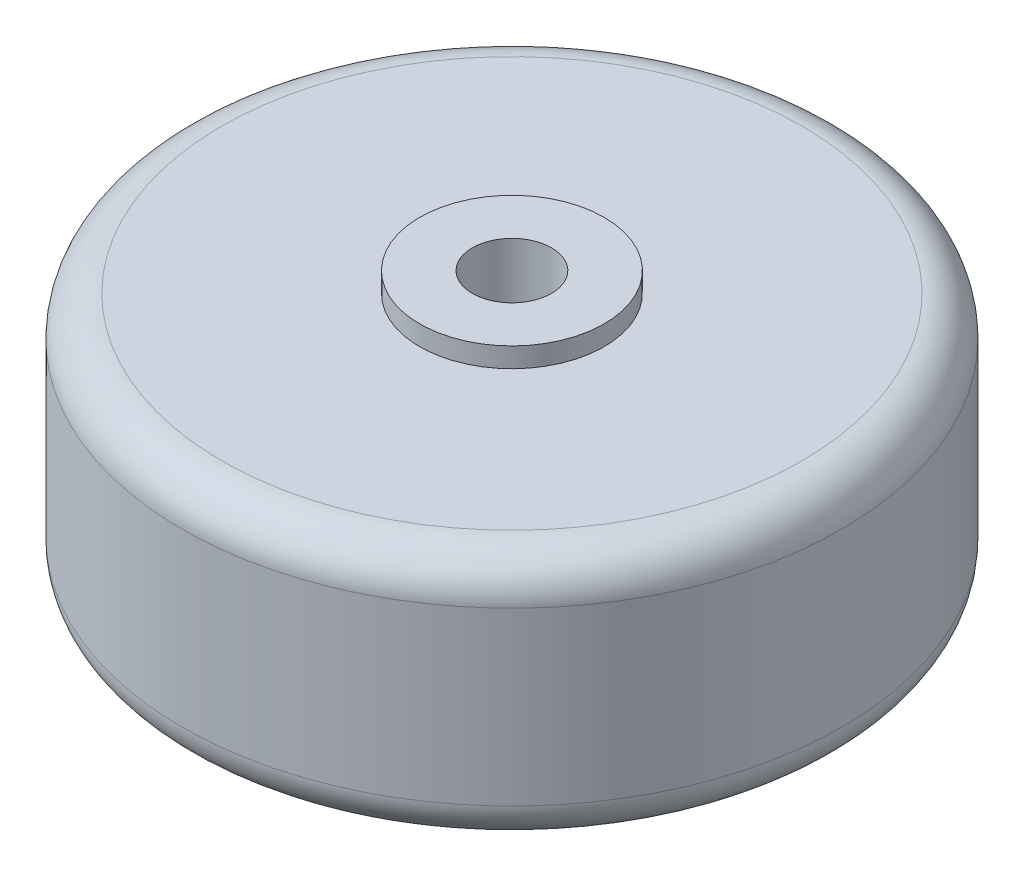
ISO-10303-21;
HEADER;
FILE_DESCRIPTION(('STEP AP214'),'2;1');
FILE_NAME('part.step','',(''),(''),'','','');
FILE_SCHEMA(('AUTOMOTIVE_DESIGN { 1 0 10303 214 1 1 1 1 }'));
ENDSEC;
DATA;
#1=APPLICATION_CONTEXT('core data for automotive mechanical design processes');
#2=APPLICATION_PROTOCOL_DEFINITION('international standard','automotive_design',2000,#1);
#3=PRODUCT_CONTEXT('',#1,'mechanical');
#4=PRODUCT('Part','Part','',(#3));
#5=PRODUCT_RELATED_PRODUCT_CATEGORY('part','',(#4));
#6=PRODUCT_DEFINITION_FORMATION('','',#4);
#7=PRODUCT_DEFINITION_CONTEXT('part definition',#1,'design');
#8=PRODUCT_DEFINITION('design','',#6,#7);
#9=PRODUCT_DEFINITION_SHAPE('','',#8);
#10=(LENGTH_UNIT() NAMED_UNIT(*) SI_UNIT(.MILLI.,.METRE.));
#11=(NAMED_UNIT(*) PLANE_ANGLE_UNIT() SI_UNIT($,.RADIAN.));
#12=(NAMED_UNIT(*) SI_UNIT($,.STERADIAN.) SOLID_ANGLE_UNIT());
#13=UNCERTAINTY_MEASURE_WITH_UNIT(LENGTH_MEASURE(1.E-05),#10,'distance_accuracy_value','');
#14=(GEOMETRIC_REPRESENTATION_CONTEXT(3) GLOBAL_UNCERTAINTY_ASSIGNED_CONTEXT((#13)) GLOBAL_UNIT_ASSIGNED_CONTEXT((#10,
#11,#12)) REPRESENTATION_CONTEXT('',''));
#15=CARTESIAN_POINT('',(0.,0.,0.));
#16=DIRECTION('',(0.,0.,1.));
#17=DIRECTION('',(1.,0.,0.));
#18=AXIS2_PLACEMENT_3D('',#15,#16,#17);
#19=CARTESIAN_POINT('',(7.,-11.,0.));
#20=DIRECTION('',(0.,-1.,0.));
#21=DIRECTION('',(0.,0.,-1.));
#22=AXIS2_PLACEMENT_3D('',#19,#20,#21);
#23=PLANE('',#22);
#24=CARTESIAN_POINT('',(0.,-11.,0.));
#25=DIRECTION('',(0.,-1.,0.));
#26=DIRECTION('',(0.,0.,-1.));
#27=AXIS2_PLACEMENT_3D('',#24,#25,#26);
#28=CIRCLE('',#27,7.);
#29=CARTESIAN_POINT('',(0.,-11.,-7.));
#30=VERTEX_POINT('',#29);
#31=EDGE_CURVE('E66',#30,#30,#28,.T.);
#32=ORIENTED_EDGE('',*,*,#31,.T.);
#33=EDGE_LOOP('',(#32));
#34=FACE_BOUND('',#33,.T.);
#35=CARTESIAN_POINT('',(0.,-11.,0.));
#36=DIRECTION('',(0.,-1.,0.));
#37=DIRECTION('',(0.,0.,-1.));
#38=AXIS2_PLACEMENT_3D('',#35,#36,#37);
#39=CIRCLE('',#38,3.);
#40=CARTESIAN_POINT('',(0.,-11.,-3.));
#41=VERTEX_POINT('',#40);
#42=EDGE_CURVE('E10',#41,#41,#39,.T.);
#43=ORIENTED_EDGE('',*,*,#42,.F.);
#44=EDGE_LOOP('',(#43));
#45=FACE_BOUND('',#44,.T.);
#46=ADVANCED_FACE('F32',(#34,#45),#23,.T.);
#47=CARTESIAN_POINT('',(0.,0.,0.));
#48=DIRECTION('',(0.,-1.,0.));
#49=DIRECTION('',(0.,0.,-1.));
#50=AXIS2_PLACEMENT_3D('',#47,#48,#49);
#51=CYLINDRICAL_SURFACE('',#50,3.);
#52=ORIENTED_EDGE('',*,*,#42,.T.);
#53=EDGE_LOOP('',(#52));
#54=FACE_BOUND('',#53,.T.);
#55=CARTESIAN_POINT('',(0.,11.,0.));
#56=DIRECTION('',(0.,-1.,0.));
#57=DIRECTION('',(0.,0.,-1.));
#58=AXIS2_PLACEMENT_3D('',#55,#56,#57);
#59=CIRCLE('',#58,3.);
#60=CARTESIAN_POINT('',(0.,11.,-3.));
#61=VERTEX_POINT('',#60);
#62=EDGE_CURVE('E38',#61,#61,#59,.T.);
#63=ORIENTED_EDGE('',*,*,#62,.F.);
#64=EDGE_LOOP('',(#63));
#65=FACE_BOUND('',#64,.T.);
#66=ADVANCED_FACE('F84',(#54,#65),#51,.F.);
#67=CARTESIAN_POINT('',(3.,11.,0.));
#68=DIRECTION('',(0.,1.,0.));
#69=DIRECTION('',(0.,0.,1.));
#70=AXIS2_PLACEMENT_3D('',#67,#68,#69);
#71=PLANE('',#70);
#72=ORIENTED_EDGE('',*,*,#62,.T.);
#73=EDGE_LOOP('',(#72));
#74=FACE_BOUND('',#73,.T.);
#75=CARTESIAN_POINT('',(0.,11.,0.));
#76=DIRECTION('',(0.,-1.,0.));
#77=DIRECTION('',(0.,0.,-1.));
#78=AXIS2_PLACEMENT_3D('',#75,#76,#77);
#79=CIRCLE('',#78,7.);
#80=CARTESIAN_POINT('',(0.,11.,-7.));
#81=VERTEX_POINT('',#80);
#82=EDGE_CURVE('E42',#81,#81,#79,.T.);
#83=ORIENTED_EDGE('',*,*,#82,.F.);
#84=EDGE_LOOP('',(#83));
#85=FACE_BOUND('',#84,.T.);
#86=ADVANCED_FACE('F88',(#74,#85),#71,.T.);
#87=CARTESIAN_POINT('',(0.,0.,0.));
#88=DIRECTION('',(0.,-1.,0.));
#89=DIRECTION('',(0.,0.,-1.));
#90=AXIS2_PLACEMENT_3D('',#87,#88,#89);
#91=CYLINDRICAL_SURFACE('',#90,7.);
#92=ORIENTED_EDGE('',*,*,#82,.T.);
#93=EDGE_LOOP('',(#92));
#94=FACE_BOUND('',#93,.T.);
#95=CARTESIAN_POINT('',(0.,9.5,0.));
#96=DIRECTION('',(0.,-1.,0.));
#97=DIRECTION('',(0.,0.,-1.));
#98=AXIS2_PLACEMENT_3D('',#95,#96,#97);
#99=CIRCLE('',#98,7.);
#100=CARTESIAN_POINT('',(0.,9.5,-7.));
#101=VERTEX_POINT('',#100);
#102=EDGE_CURVE('E46',#101,#101,#99,.T.);
#103=ORIENTED_EDGE('',*,*,#102,.F.);
#104=EDGE_LOOP('',(#103));
#105=FACE_BOUND('',#104,.T.);
#106=ADVANCED_FACE('F92',(#94,#105),#91,.T.);
#107=CARTESIAN_POINT('',(7.,9.5,0.));
#108=DIRECTION('',(0.,1.,0.));
#109=DIRECTION('',(0.,0.,1.));
#110=AXIS2_PLACEMENT_3D('',#107,#108,#109);
#111=PLANE('',#110);
#112=ORIENTED_EDGE('',*,*,#102,.T.);
#113=EDGE_LOOP('',(#112));
#114=FACE_BOUND('',#113,.T.);
#115=CARTESIAN_POINT('',(0.,9.5,0.));
#116=DIRECTION('',(0.,-1.,0.));
#117=DIRECTION('',(0.,0.,-1.));
#118=AXIS2_PLACEMENT_3D('',#115,#116,#117);
#119=CIRCLE('',#118,22.);
#120=CARTESIAN_POINT('',(0.,9.5,-22.));
#121=VERTEX_POINT('',#120);
#122=EDGE_CURVE('E51',#121,#121,#119,.T.);
#123=ORIENTED_EDGE('',*,*,#122,.F.);
#124=EDGE_LOOP('',(#123));
#125=FACE_BOUND('',#124,.T.);
#126=ADVANCED_FACE('F98',(#114,#125),#111,.T.);
#127=CARTESIAN_POINT('',(0.,6.5,0.));
#128=DIRECTION('',(0.,-1.,0.));
#129=DIRECTION('',(0.,0.,-1.));
#130=AXIS2_PLACEMENT_3D('',#127,#128,#129);
#131=TOROIDAL_SURFACE('',#130,22.,3.);
#132=ORIENTED_EDGE('',*,*,#122,.T.);
#133=EDGE_LOOP('',(#132));
#134=FACE_BOUND('',#133,.T.);
#135=CARTESIAN_POINT('',(0.,6.49999999999998,0.));
#136=DIRECTION('',(0.,-1.,0.));
#137=DIRECTION('',(0.,0.,-1.));
#138=AXIS2_PLACEMENT_3D('',#135,#136,#137);
#139=CIRCLE('',#138,25.);
#140=CARTESIAN_POINT('',(0.,6.49999999999998,-25.));
#141=VERTEX_POINT('',#140);
#142=EDGE_CURVE('E54',#141,#141,#139,.T.);
#143=ORIENTED_EDGE('',*,*,#142,.F.);
#144=EDGE_LOOP('',(#143));
#145=FACE_BOUND('',#144,.T.);
#146=ADVANCED_FACE('F102',(#134,#145),#131,.T.);
#147=CARTESIAN_POINT('',(0.,0.,0.));
#148=DIRECTION('',(0.,-1.,0.));
#149=DIRECTION('',(0.,0.,-1.));
#150=AXIS2_PLACEMENT_3D('',#147,#148,#149);
#151=CYLINDRICAL_SURFACE('',#150,25.);
#152=ORIENTED_EDGE('',*,*,#142,.T.);
#153=EDGE_LOOP('',(#152));
#154=FACE_BOUND('',#153,.T.);
#155=CARTESIAN_POINT('',(0.,-6.49999999999998,0.));
#156=DIRECTION('',(0.,-1.,0.));
#157=DIRECTION('',(0.,0.,-1.));
#158=AXIS2_PLACEMENT_3D('',#155,#156,#157);
#159=CIRCLE('',#158,25.);
#160=CARTESIAN_POINT('',(0.,-6.49999999999998,-25.));
#161=VERTEX_POINT('',#160);
#162=EDGE_CURVE('E57',#161,#161,#159,.T.);
#163=ORIENTED_EDGE('',*,*,#162,.F.);
#164=EDGE_LOOP('',(#163));
#165=FACE_BOUND('',#164,.T.);
#166=ADVANCED_FACE('F106',(#154,#165),#151,.T.);
#167=CARTESIAN_POINT('',(0.,-6.5,0.));
#168=DIRECTION('',(0.,-1.,0.));
#169=DIRECTION('',(0.,0.,-1.));
#170=AXIS2_PLACEMENT_3D('',#167,#168,#169);
#171=TOROIDAL_SURFACE('',#170,22.,3.);
#172=ORIENTED_EDGE('',*,*,#162,.T.);
#173=EDGE_LOOP('',(#172));
#174=FACE_BOUND('',#173,.T.);
#175=CARTESIAN_POINT('',(0.,-9.5,0.));
#176=DIRECTION('',(0.,-1.,0.));
#177=DIRECTION('',(0.,0.,-1.));
#178=AXIS2_PLACEMENT_3D('',#175,#176,#177);
#179=CIRCLE('',#178,22.);
#180=CARTESIAN_POINT('',(0.,-9.5,-22.));
#181=VERTEX_POINT('',#180);
#182=EDGE_CURVE('E60',#181,#181,#179,.T.);
#183=ORIENTED_EDGE('',*,*,#182,.F.);
#184=EDGE_LOOP('',(#183));
#185=FACE_BOUND('',#184,.T.);
#186=ADVANCED_FACE('F80',(#174,#185),#171,.T.);
#187=CARTESIAN_POINT('',(22.,-9.5,0.));
#188=DIRECTION('',(0.,-1.,0.));
#189=DIRECTION('',(0.,0.,-1.));
#190=AXIS2_PLACEMENT_3D('',#187,#188,#189);
#191=PLANE('',#190);
#192=ORIENTED_EDGE('',*,*,#182,.T.);
#193=EDGE_LOOP('',(#192));
#194=FACE_BOUND('',#193,.T.);
#195=CARTESIAN_POINT('',(0.,-9.5,0.));
#196=DIRECTION('',(0.,-1.,0.));
#197=DIRECTION('',(0.,0.,-1.));
#198=AXIS2_PLACEMENT_3D('',#195,#196,#197);
#199=CIRCLE('',#198,7.);
#200=CARTESIAN_POINT('',(0.,-9.5,-7.));
#201=VERTEX_POINT('',#200);
#202=EDGE_CURVE('E63',#201,#201,#199,.T.);
#203=ORIENTED_EDGE('',*,*,#202,.F.);
#204=EDGE_LOOP('',(#203));
#205=FACE_BOUND('',#204,.T.);
#206=ADVANCED_FACE('F74',(#194,#205),#191,.T.);
#207=CARTESIAN_POINT('',(0.,0.,0.));
#208=DIRECTION('',(0.,-1.,0.));
#209=DIRECTION('',(0.,0.,-1.));
#210=AXIS2_PLACEMENT_3D('',#207,#208,#209);
#211=CYLINDRICAL_SURFACE('',#210,7.);
#212=ORIENTED_EDGE('',*,*,#202,.T.);
#213=EDGE_LOOP('',(#212));
#214=FACE_BOUND('',#213,.T.);
#215=ORIENTED_EDGE('',*,*,#31,.F.);
#216=EDGE_LOOP('',(#215));
#217=FACE_BOUND('',#216,.T.);
#218=ADVANCED_FACE('F72',(#214,#217),#211,.T.);
#219=CLOSED_SHELL('',(#46,#66,#86,#106,#126,#146,#166,#186,#206,#218));
#220=MANIFOLD_SOLID_BREP('B2',#219);
#221=ADVANCED_BREP_SHAPE_REPRESENTATION('',(#18,#220),#14);
#222=SHAPE_DEFINITION_REPRESENTATION(#9,#221);
ENDSEC;
END-ISO-10303-21;
